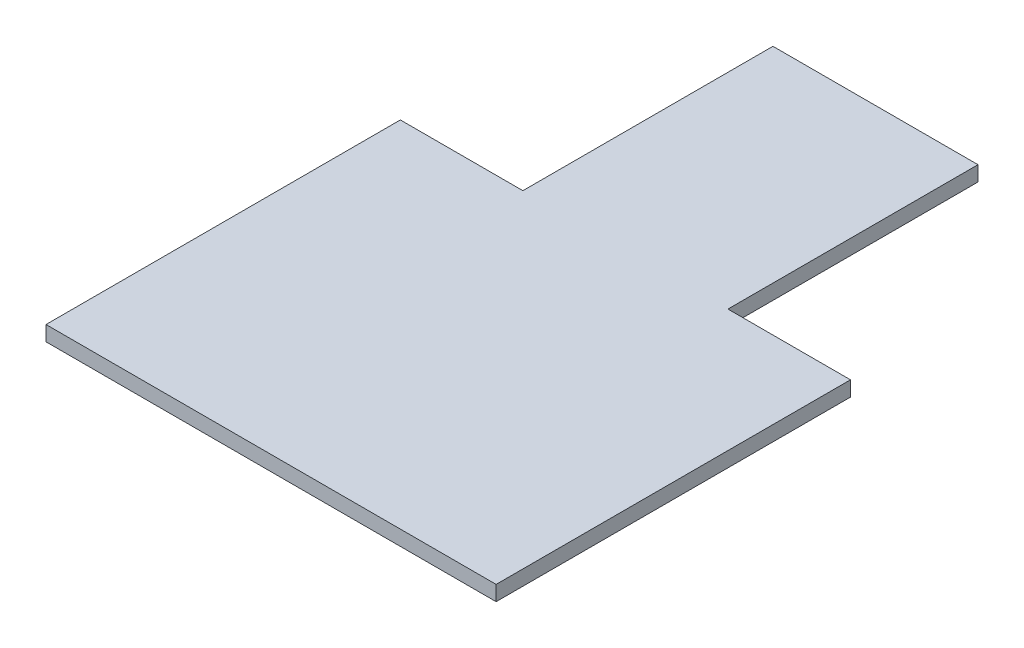
ISO-10303-21;
HEADER;
FILE_DESCRIPTION(('STEP AP214'),'2;1');
FILE_NAME('part.step','',(''),(''),'','','');
FILE_SCHEMA(('AUTOMOTIVE_DESIGN { 1 0 10303 214 1 1 1 1 }'));
ENDSEC;
DATA;
#1=APPLICATION_CONTEXT('core data for automotive mechanical design processes');
#2=APPLICATION_PROTOCOL_DEFINITION('international standard','automotive_design',2000,#1);
#3=PRODUCT_CONTEXT('',#1,'mechanical');
#4=PRODUCT('Part','Part','',(#3));
#5=PRODUCT_RELATED_PRODUCT_CATEGORY('part','',(#4));
#6=PRODUCT_DEFINITION_FORMATION('','',#4);
#7=PRODUCT_DEFINITION_CONTEXT('part definition',#1,'design');
#8=PRODUCT_DEFINITION('design','',#6,#7);
#9=PRODUCT_DEFINITION_SHAPE('','',#8);
#10=(LENGTH_UNIT() NAMED_UNIT(*) SI_UNIT(.MILLI.,.METRE.));
#11=(NAMED_UNIT(*) PLANE_ANGLE_UNIT() SI_UNIT($,.RADIAN.));
#12=(NAMED_UNIT(*) SI_UNIT($,.STERADIAN.) SOLID_ANGLE_UNIT());
#13=UNCERTAINTY_MEASURE_WITH_UNIT(LENGTH_MEASURE(1.E-05),#10,'distance_accuracy_value','');
#14=(GEOMETRIC_REPRESENTATION_CONTEXT(3) GLOBAL_UNCERTAINTY_ASSIGNED_CONTEXT((#13)) GLOBAL_UNIT_ASSIGNED_CONTEXT((#10,
#11,#12)) REPRESENTATION_CONTEXT('',''));
#15=CARTESIAN_POINT('',(0.,0.,0.));
#16=DIRECTION('',(0.,0.,1.));
#17=DIRECTION('',(1.,0.,0.));
#18=AXIS2_PLACEMENT_3D('',#15,#16,#17);
#19=CARTESIAN_POINT('',(45.,3.,-10.8045977011494));
#20=DIRECTION('',(-1.,0.,0.));
#21=DIRECTION('',(0.,0.,1.));
#22=AXIS2_PLACEMENT_3D('',#19,#20,#21);
#23=PLANE('',#22);
#24=DIRECTION('',(0.,0.,-1.));
#25=VECTOR('',#24,1.);
#26=CARTESIAN_POINT('',(45.,0.,-10.8045977011494));
#27=LINE('',#26,#25);
#28=CARTESIAN_POINT('',(45.,0.,60.0459770114943));
#29=VERTEX_POINT('',#28);
#30=CARTESIAN_POINT('',(45.,0.,-10.8045977011494));
#31=VERTEX_POINT('',#30);
#32=EDGE_CURVE('E129',#29,#31,#27,.T.);
#33=ORIENTED_EDGE('',*,*,#32,.T.);
#34=DIRECTION('',(0.,-1.,0.));
#35=VECTOR('',#34,1.);
#36=CARTESIAN_POINT('',(45.,3.,-10.8045977011494));
#37=LINE('',#36,#35);
#38=CARTESIAN_POINT('',(45.,3.,-10.8045977011494));
#39=VERTEX_POINT('',#38);
#40=EDGE_CURVE('E11',#39,#31,#37,.T.);
#41=ORIENTED_EDGE('',*,*,#40,.F.);
#42=DIRECTION('',(0.,0.,-1.));
#43=VECTOR('',#42,1.);
#44=CARTESIAN_POINT('',(45.,3.,-10.8045977011494));
#45=LINE('',#44,#43);
#46=CARTESIAN_POINT('',(45.,3.,60.0459770114943));
#47=VERTEX_POINT('',#46);
#48=EDGE_CURVE('E143',#47,#39,#45,.T.);
#49=ORIENTED_EDGE('',*,*,#48,.F.);
#50=DIRECTION('',(0.,-1.,0.));
#51=VECTOR('',#50,1.);
#52=CARTESIAN_POINT('',(45.,3.,60.0459770114943));
#53=LINE('',#52,#51);
#54=EDGE_CURVE('E125',#47,#29,#53,.T.);
#55=ORIENTED_EDGE('',*,*,#54,.T.);
#56=EDGE_LOOP('',(#33,#41,#49,#55));
#57=FACE_BOUND('',#56,.T.);
#58=ADVANCED_FACE('F33',(#57),#23,.F.);
#59=CARTESIAN_POINT('',(20.5,3.,-10.8045977011494));
#60=DIRECTION('',(0.,0.,1.));
#61=DIRECTION('',(1.,0.,0.));
#62=AXIS2_PLACEMENT_3D('',#59,#60,#61);
#63=PLANE('',#62);
#64=DIRECTION('',(-1.,0.,0.));
#65=VECTOR('',#64,1.);
#66=CARTESIAN_POINT('',(20.5,0.,-10.8045977011494));
#67=LINE('',#66,#65);
#68=CARTESIAN_POINT('',(20.5,0.,-10.8045977011494));
#69=VERTEX_POINT('',#68);
#70=EDGE_CURVE('E132',#31,#69,#67,.T.);
#71=ORIENTED_EDGE('',*,*,#70,.T.);
#72=DIRECTION('',(0.,-1.,0.));
#73=VECTOR('',#72,1.);
#74=CARTESIAN_POINT('',(20.5,3.,-10.8045977011494));
#75=LINE('',#74,#73);
#76=CARTESIAN_POINT('',(20.5,3.,-10.8045977011494));
#77=VERTEX_POINT('',#76);
#78=EDGE_CURVE('E41',#77,#69,#75,.T.);
#79=ORIENTED_EDGE('',*,*,#78,.F.);
#80=DIRECTION('',(-1.,0.,0.));
#81=VECTOR('',#80,1.);
#82=CARTESIAN_POINT('',(20.5,3.,-10.8045977011494));
#83=LINE('',#82,#81);
#84=EDGE_CURVE('E92',#39,#77,#83,.T.);
#85=ORIENTED_EDGE('',*,*,#84,.F.);
#86=ORIENTED_EDGE('',*,*,#40,.T.);
#87=EDGE_LOOP('',(#71,#79,#85,#86));
#88=FACE_BOUND('',#87,.T.);
#89=ADVANCED_FACE('F178',(#88),#63,.F.);
#90=CARTESIAN_POINT('',(20.5,3.,-60.8045977011494));
#91=DIRECTION('',(-1.,0.,0.));
#92=DIRECTION('',(0.,0.,1.));
#93=AXIS2_PLACEMENT_3D('',#90,#91,#92);
#94=PLANE('',#93);
#95=DIRECTION('',(0.,0.,-1.));
#96=VECTOR('',#95,1.);
#97=CARTESIAN_POINT('',(20.5,0.,-60.8045977011494));
#98=LINE('',#97,#96);
#99=CARTESIAN_POINT('',(20.5,0.,-60.8045977011494));
#100=VERTEX_POINT('',#99);
#101=EDGE_CURVE('E134',#69,#100,#98,.T.);
#102=ORIENTED_EDGE('',*,*,#101,.T.);
#103=DIRECTION('',(0.,-1.,0.));
#104=VECTOR('',#103,1.);
#105=CARTESIAN_POINT('',(20.5,3.,-60.8045977011494));
#106=LINE('',#105,#104);
#107=CARTESIAN_POINT('',(20.5,3.,-60.8045977011494));
#108=VERTEX_POINT('',#107);
#109=EDGE_CURVE('E150',#108,#100,#106,.T.);
#110=ORIENTED_EDGE('',*,*,#109,.F.);
#111=DIRECTION('',(0.,0.,-1.));
#112=VECTOR('',#111,1.);
#113=CARTESIAN_POINT('',(20.5,3.,-60.8045977011494));
#114=LINE('',#113,#112);
#115=EDGE_CURVE('E158',#77,#108,#114,.T.);
#116=ORIENTED_EDGE('',*,*,#115,.F.);
#117=ORIENTED_EDGE('',*,*,#78,.T.);
#118=EDGE_LOOP('',(#102,#110,#116,#117));
#119=FACE_BOUND('',#118,.T.);
#120=ADVANCED_FACE('F156',(#119),#94,.F.);
#121=CARTESIAN_POINT('',(20.5,3.,-60.8045977011494));
#122=DIRECTION('',(0.,0.,1.));
#123=DIRECTION('',(1.,0.,0.));
#124=AXIS2_PLACEMENT_3D('',#121,#122,#123);
#125=PLANE('',#124);
#126=DIRECTION('',(-1.,0.,0.));
#127=VECTOR('',#126,1.);
#128=CARTESIAN_POINT('',(20.5,0.,-60.8045977011494));
#129=LINE('',#128,#127);
#130=CARTESIAN_POINT('',(-20.5,0.,-60.8045977011494));
#131=VERTEX_POINT('',#130);
#132=EDGE_CURVE('E136',#100,#131,#129,.T.);
#133=ORIENTED_EDGE('',*,*,#132,.T.);
#134=DIRECTION('',(0.,-1.,0.));
#135=VECTOR('',#134,1.);
#136=CARTESIAN_POINT('',(-20.5,3.,-60.8045977011494));
#137=LINE('',#136,#135);
#138=CARTESIAN_POINT('',(-20.5,3.,-60.8045977011494));
#139=VERTEX_POINT('',#138);
#140=EDGE_CURVE('E147',#139,#131,#137,.T.);
#141=ORIENTED_EDGE('',*,*,#140,.F.);
#142=DIRECTION('',(-1.,0.,0.));
#143=VECTOR('',#142,1.);
#144=CARTESIAN_POINT('',(20.5,3.,-60.8045977011494));
#145=LINE('',#144,#143);
#146=EDGE_CURVE('E170',#108,#139,#145,.T.);
#147=ORIENTED_EDGE('',*,*,#146,.F.);
#148=ORIENTED_EDGE('',*,*,#109,.T.);
#149=EDGE_LOOP('',(#133,#141,#147,#148));
#150=FACE_BOUND('',#149,.T.);
#151=ADVANCED_FACE('F166',(#150),#125,.F.);
#152=CARTESIAN_POINT('',(-20.5,3.,-60.8045977011494));
#153=DIRECTION('',(1.,0.,0.));
#154=DIRECTION('',(0.,0.,-1.));
#155=AXIS2_PLACEMENT_3D('',#152,#153,#154);
#156=PLANE('',#155);
#157=DIRECTION('',(0.,0.,1.));
#158=VECTOR('',#157,1.);
#159=CARTESIAN_POINT('',(-20.5,0.,-60.8045977011494));
#160=LINE('',#159,#158);
#161=CARTESIAN_POINT('',(-20.5,0.,-10.8045977011494));
#162=VERTEX_POINT('',#161);
#163=EDGE_CURVE('E138',#131,#162,#160,.T.);
#164=ORIENTED_EDGE('',*,*,#163,.T.);
#165=DIRECTION('',(0.,-1.,0.));
#166=VECTOR('',#165,1.);
#167=CARTESIAN_POINT('',(-20.5,3.,-10.8045977011494));
#168=LINE('',#167,#166);
#169=CARTESIAN_POINT('',(-20.5,3.,-10.8045977011494));
#170=VERTEX_POINT('',#169);
#171=EDGE_CURVE('E120',#170,#162,#168,.T.);
#172=ORIENTED_EDGE('',*,*,#171,.F.);
#173=DIRECTION('',(0.,0.,1.));
#174=VECTOR('',#173,1.);
#175=CARTESIAN_POINT('',(-20.5,3.,-60.8045977011494));
#176=LINE('',#175,#174);
#177=EDGE_CURVE('E111',#139,#170,#176,.T.);
#178=ORIENTED_EDGE('',*,*,#177,.F.);
#179=ORIENTED_EDGE('',*,*,#140,.T.);
#180=EDGE_LOOP('',(#164,#172,#178,#179));
#181=FACE_BOUND('',#180,.T.);
#182=ADVANCED_FACE('F169',(#181),#156,.F.);
#183=CARTESIAN_POINT('',(-20.5,3.,-10.8045977011494));
#184=DIRECTION('',(0.,0.,1.));
#185=DIRECTION('',(1.,0.,0.));
#186=AXIS2_PLACEMENT_3D('',#183,#184,#185);
#187=PLANE('',#186);
#188=DIRECTION('',(-1.,0.,0.));
#189=VECTOR('',#188,1.);
#190=CARTESIAN_POINT('',(-20.5,0.,-10.8045977011494));
#191=LINE('',#190,#189);
#192=CARTESIAN_POINT('',(-45.,0.,-10.8045977011494));
#193=VERTEX_POINT('',#192);
#194=EDGE_CURVE('E119',#162,#193,#191,.T.);
#195=ORIENTED_EDGE('',*,*,#194,.T.);
#196=DIRECTION('',(0.,-1.,0.));
#197=VECTOR('',#196,1.);
#198=CARTESIAN_POINT('',(-45.,3.,-10.8045977011494));
#199=LINE('',#198,#197);
#200=CARTESIAN_POINT('',(-45.,3.,-10.8045977011494));
#201=VERTEX_POINT('',#200);
#202=EDGE_CURVE('E116',#201,#193,#199,.T.);
#203=ORIENTED_EDGE('',*,*,#202,.F.);
#204=DIRECTION('',(-1.,0.,0.));
#205=VECTOR('',#204,1.);
#206=CARTESIAN_POINT('',(-20.5,3.,-10.8045977011494));
#207=LINE('',#206,#205);
#208=EDGE_CURVE('E105',#170,#201,#207,.T.);
#209=ORIENTED_EDGE('',*,*,#208,.F.);
#210=ORIENTED_EDGE('',*,*,#171,.T.);
#211=EDGE_LOOP('',(#195,#203,#209,#210));
#212=FACE_BOUND('',#211,.T.);
#213=ADVANCED_FACE('F117',(#212),#187,.F.);
#214=CARTESIAN_POINT('',(-45.,3.,-10.8045977011494));
#215=DIRECTION('',(1.,0.,0.));
#216=DIRECTION('',(0.,0.,-1.));
#217=AXIS2_PLACEMENT_3D('',#214,#215,#216);
#218=PLANE('',#217);
#219=DIRECTION('',(0.,0.,1.));
#220=VECTOR('',#219,1.);
#221=CARTESIAN_POINT('',(-45.,0.,-10.8045977011494));
#222=LINE('',#221,#220);
#223=CARTESIAN_POINT('',(-45.,0.,60.0459770114943));
#224=VERTEX_POINT('',#223);
#225=EDGE_CURVE('E78',#193,#224,#222,.T.);
#226=ORIENTED_EDGE('',*,*,#225,.T.);
#227=DIRECTION('',(0.,-1.,0.));
#228=VECTOR('',#227,1.);
#229=CARTESIAN_POINT('',(-45.,3.,60.0459770114943));
#230=LINE('',#229,#228);
#231=CARTESIAN_POINT('',(-45.,3.,60.0459770114943));
#232=VERTEX_POINT('',#231);
#233=EDGE_CURVE('E121',#232,#224,#230,.T.);
#234=ORIENTED_EDGE('',*,*,#233,.F.);
#235=DIRECTION('',(0.,0.,1.));
#236=VECTOR('',#235,1.);
#237=CARTESIAN_POINT('',(-45.,3.,-10.8045977011494));
#238=LINE('',#237,#236);
#239=EDGE_CURVE('E109',#201,#232,#238,.T.);
#240=ORIENTED_EDGE('',*,*,#239,.F.);
#241=ORIENTED_EDGE('',*,*,#202,.T.);
#242=EDGE_LOOP('',(#226,#234,#240,#241));
#243=FACE_BOUND('',#242,.T.);
#244=ADVANCED_FACE('F123',(#243),#218,.F.);
#245=CARTESIAN_POINT('',(-45.,3.,60.0459770114943));
#246=DIRECTION('',(0.,0.,-1.));
#247=DIRECTION('',(-1.,0.,0.));
#248=AXIS2_PLACEMENT_3D('',#245,#246,#247);
#249=PLANE('',#248);
#250=DIRECTION('',(1.,0.,0.));
#251=VECTOR('',#250,1.);
#252=CARTESIAN_POINT('',(-45.,0.,60.0459770114943));
#253=LINE('',#252,#251);
#254=EDGE_CURVE('E84',#224,#29,#253,.T.);
#255=ORIENTED_EDGE('',*,*,#254,.T.);
#256=ORIENTED_EDGE('',*,*,#54,.F.);
#257=DIRECTION('',(1.,0.,0.));
#258=VECTOR('',#257,1.);
#259=CARTESIAN_POINT('',(-45.,3.,60.0459770114943));
#260=LINE('',#259,#258);
#261=EDGE_CURVE('E49',#232,#47,#260,.T.);
#262=ORIENTED_EDGE('',*,*,#261,.F.);
#263=ORIENTED_EDGE('',*,*,#233,.T.);
#264=EDGE_LOOP('',(#255,#256,#262,#263));
#265=FACE_BOUND('',#264,.T.);
#266=ADVANCED_FACE('F194',(#265),#249,.F.);
#267=CARTESIAN_POINT('',(0.,3.,0.));
#268=DIRECTION('',(0.,1.,0.));
#269=DIRECTION('',(0.,0.,1.));
#270=AXIS2_PLACEMENT_3D('',#267,#268,#269);
#271=PLANE('',#270);
#272=ORIENTED_EDGE('',*,*,#48,.T.);
#273=ORIENTED_EDGE('',*,*,#84,.T.);
#274=ORIENTED_EDGE('',*,*,#115,.T.);
#275=ORIENTED_EDGE('',*,*,#146,.T.);
#276=ORIENTED_EDGE('',*,*,#177,.T.);
#277=ORIENTED_EDGE('',*,*,#208,.T.);
#278=ORIENTED_EDGE('',*,*,#239,.T.);
#279=ORIENTED_EDGE('',*,*,#261,.T.);
#280=EDGE_LOOP('',(#272,#273,#274,#275,#276,#277,#278,#279));
#281=FACE_BOUND('',#280,.T.);
#282=ADVANCED_FACE('F107',(#281),#271,.T.);
#283=CARTESIAN_POINT('',(0.,0.,0.));
#284=DIRECTION('',(0.,1.,0.));
#285=DIRECTION('',(0.,0.,1.));
#286=AXIS2_PLACEMENT_3D('',#283,#284,#285);
#287=PLANE('',#286);
#288=ORIENTED_EDGE('',*,*,#32,.F.);
#289=ORIENTED_EDGE('',*,*,#254,.F.);
#290=ORIENTED_EDGE('',*,*,#225,.F.);
#291=ORIENTED_EDGE('',*,*,#194,.F.);
#292=ORIENTED_EDGE('',*,*,#163,.F.);
#293=ORIENTED_EDGE('',*,*,#132,.F.);
#294=ORIENTED_EDGE('',*,*,#101,.F.);
#295=ORIENTED_EDGE('',*,*,#70,.F.);
#296=EDGE_LOOP('',(#288,#289,#290,#291,#292,#293,#294,#295));
#297=FACE_BOUND('',#296,.T.);
#298=ADVANCED_FACE('F162',(#297),#287,.F.);
#299=CLOSED_SHELL('',(#58,#89,#120,#151,#182,#213,#244,#266,#282,#298));
#300=MANIFOLD_SOLID_BREP('B2',#299);
#301=ADVANCED_BREP_SHAPE_REPRESENTATION('',(#18,#300),#14);
#302=SHAPE_DEFINITION_REPRESENTATION(#9,#301);
ENDSEC;
END-ISO-10303-21;
